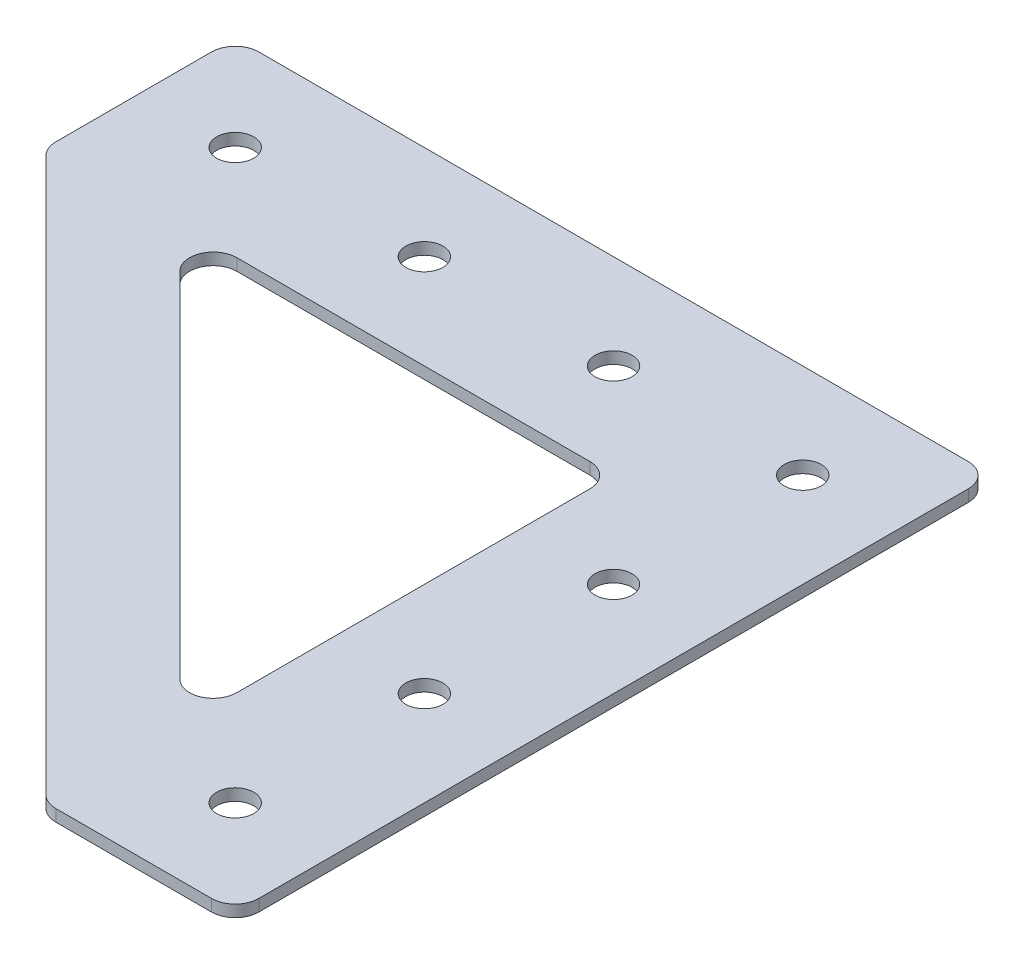
ISO-10303-21;
HEADER;
FILE_DESCRIPTION(('STEP AP214'),'2;1');
FILE_NAME('part.step','',(''),(''),'','','');
FILE_SCHEMA(('AUTOMOTIVE_DESIGN { 1 0 10303 214 1 1 1 1 }'));
ENDSEC;
DATA;
#1=APPLICATION_CONTEXT('core data for automotive mechanical design processes');
#2=APPLICATION_PROTOCOL_DEFINITION('international standard','automotive_design',2000,#1);
#3=PRODUCT_CONTEXT('',#1,'mechanical');
#4=PRODUCT('Part','Part','',(#3));
#5=PRODUCT_RELATED_PRODUCT_CATEGORY('part','',(#4));
#6=PRODUCT_DEFINITION_FORMATION('','',#4);
#7=PRODUCT_DEFINITION_CONTEXT('part definition',#1,'design');
#8=PRODUCT_DEFINITION('design','',#6,#7);
#9=PRODUCT_DEFINITION_SHAPE('','',#8);
#10=(LENGTH_UNIT() NAMED_UNIT(*) SI_UNIT(.MILLI.,.METRE.));
#11=(NAMED_UNIT(*) PLANE_ANGLE_UNIT() SI_UNIT($,.RADIAN.));
#12=(NAMED_UNIT(*) SI_UNIT($,.STERADIAN.) SOLID_ANGLE_UNIT());
#13=UNCERTAINTY_MEASURE_WITH_UNIT(LENGTH_MEASURE(1.E-05),#10,'distance_accuracy_value','');
#14=(GEOMETRIC_REPRESENTATION_CONTEXT(3) GLOBAL_UNCERTAINTY_ASSIGNED_CONTEXT((#13)) GLOBAL_UNIT_ASSIGNED_CONTEXT((#10,
#11,#12)) REPRESENTATION_CONTEXT('',''));
#15=CARTESIAN_POINT('',(0.,0.,0.));
#16=DIRECTION('',(0.,0.,1.));
#17=DIRECTION('',(1.,0.,0.));
#18=AXIS2_PLACEMENT_3D('',#15,#16,#17);
#19=CARTESIAN_POINT('',(-88.9,0.,12.7));
#20=DIRECTION('',(0.,1.,0.));
#21=DIRECTION('',(0.,0.,1.));
#22=AXIS2_PLACEMENT_3D('',#19,#20,#21);
#23=CYLINDRICAL_SURFACE('',#22,2.4892);
#24=CARTESIAN_POINT('',(-88.9,0.,12.7));
#25=DIRECTION('',(0.,1.,0.));
#26=DIRECTION('',(0.,0.,1.));
#27=AXIS2_PLACEMENT_3D('',#24,#25,#26);
#28=CIRCLE('',#27,2.4892);
#29=CARTESIAN_POINT('',(-88.9,0.,15.1892));
#30=VERTEX_POINT('',#29);
#31=EDGE_CURVE('E181',#30,#30,#28,.T.);
#32=ORIENTED_EDGE('',*,*,#31,.F.);
#33=EDGE_LOOP('',(#32));
#34=FACE_BOUND('',#33,.T.);
#35=CARTESIAN_POINT('',(-88.9,1.5875,12.7));
#36=DIRECTION('',(0.,1.,0.));
#37=DIRECTION('',(0.,0.,1.));
#38=AXIS2_PLACEMENT_3D('',#35,#36,#37);
#39=CIRCLE('',#38,2.4892);
#40=CARTESIAN_POINT('',(-88.9,1.5875,15.1892));
#41=VERTEX_POINT('',#40);
#42=EDGE_CURVE('E176',#41,#41,#39,.T.);
#43=ORIENTED_EDGE('',*,*,#42,.T.);
#44=EDGE_LOOP('',(#43));
#45=FACE_BOUND('',#44,.T.);
#46=ADVANCED_FACE('F37',(#34,#45),#23,.F.);
#47=CARTESIAN_POINT('',(-63.5,0.,12.7));
#48=DIRECTION('',(0.,1.,0.));
#49=DIRECTION('',(0.,0.,1.));
#50=AXIS2_PLACEMENT_3D('',#47,#48,#49);
#51=CYLINDRICAL_SURFACE('',#50,2.4892);
#52=CARTESIAN_POINT('',(-63.5,0.,12.7));
#53=DIRECTION('',(0.,1.,0.));
#54=DIRECTION('',(0.,0.,1.));
#55=AXIS2_PLACEMENT_3D('',#52,#53,#54);
#56=CIRCLE('',#55,2.4892);
#57=CARTESIAN_POINT('',(-63.5,0.,15.1892));
#58=VERTEX_POINT('',#57);
#59=EDGE_CURVE('E314',#58,#58,#56,.T.);
#60=ORIENTED_EDGE('',*,*,#59,.F.);
#61=EDGE_LOOP('',(#60));
#62=FACE_BOUND('',#61,.T.);
#63=CARTESIAN_POINT('',(-63.5,1.5875,12.7));
#64=DIRECTION('',(0.,1.,0.));
#65=DIRECTION('',(0.,0.,1.));
#66=AXIS2_PLACEMENT_3D('',#63,#64,#65);
#67=CIRCLE('',#66,2.4892);
#68=CARTESIAN_POINT('',(-63.5,1.5875,15.1892));
#69=VERTEX_POINT('',#68);
#70=EDGE_CURVE('E317',#69,#69,#67,.T.);
#71=ORIENTED_EDGE('',*,*,#70,.T.);
#72=EDGE_LOOP('',(#71));
#73=FACE_BOUND('',#72,.T.);
#74=ADVANCED_FACE('F325',(#62,#73),#51,.F.);
#75=CARTESIAN_POINT('',(-38.1,0.,12.7));
#76=DIRECTION('',(0.,1.,0.));
#77=DIRECTION('',(0.,0.,1.));
#78=AXIS2_PLACEMENT_3D('',#75,#76,#77);
#79=CYLINDRICAL_SURFACE('',#78,2.4892);
#80=CARTESIAN_POINT('',(-38.1,0.,12.7));
#81=DIRECTION('',(0.,1.,0.));
#82=DIRECTION('',(0.,0.,1.));
#83=AXIS2_PLACEMENT_3D('',#80,#81,#82);
#84=CIRCLE('',#83,2.4892);
#85=CARTESIAN_POINT('',(-38.1,0.,15.1892));
#86=VERTEX_POINT('',#85);
#87=EDGE_CURVE('E308',#86,#86,#84,.T.);
#88=ORIENTED_EDGE('',*,*,#87,.F.);
#89=EDGE_LOOP('',(#88));
#90=FACE_BOUND('',#89,.T.);
#91=CARTESIAN_POINT('',(-38.1,1.5875,12.7));
#92=DIRECTION('',(0.,1.,0.));
#93=DIRECTION('',(0.,0.,1.));
#94=AXIS2_PLACEMENT_3D('',#91,#92,#93);
#95=CIRCLE('',#94,2.4892);
#96=CARTESIAN_POINT('',(-38.1,1.5875,15.1892));
#97=VERTEX_POINT('',#96);
#98=EDGE_CURVE('E311',#97,#97,#95,.T.);
#99=ORIENTED_EDGE('',*,*,#98,.T.);
#100=EDGE_LOOP('',(#99));
#101=FACE_BOUND('',#100,.T.);
#102=ADVANCED_FACE('F368',(#90,#101),#79,.F.);
#103=CARTESIAN_POINT('',(-12.7,0.,88.9));
#104=DIRECTION('',(0.,1.,0.));
#105=DIRECTION('',(0.,0.,1.));
#106=AXIS2_PLACEMENT_3D('',#103,#104,#105);
#107=CYLINDRICAL_SURFACE('',#106,2.4892);
#108=CARTESIAN_POINT('',(-12.7,0.,88.9));
#109=DIRECTION('',(0.,1.,0.));
#110=DIRECTION('',(0.,0.,1.));
#111=AXIS2_PLACEMENT_3D('',#108,#109,#110);
#112=CIRCLE('',#111,2.4892);
#113=CARTESIAN_POINT('',(-12.7,0.,91.3892));
#114=VERTEX_POINT('',#113);
#115=EDGE_CURVE('E302',#114,#114,#112,.T.);
#116=ORIENTED_EDGE('',*,*,#115,.F.);
#117=EDGE_LOOP('',(#116));
#118=FACE_BOUND('',#117,.T.);
#119=CARTESIAN_POINT('',(-12.7,1.5875,88.9));
#120=DIRECTION('',(0.,1.,0.));
#121=DIRECTION('',(0.,0.,1.));
#122=AXIS2_PLACEMENT_3D('',#119,#120,#121);
#123=CIRCLE('',#122,2.4892);
#124=CARTESIAN_POINT('',(-12.7,1.5875,91.3892));
#125=VERTEX_POINT('',#124);
#126=EDGE_CURVE('E305',#125,#125,#123,.T.);
#127=ORIENTED_EDGE('',*,*,#126,.T.);
#128=EDGE_LOOP('',(#127));
#129=FACE_BOUND('',#128,.T.);
#130=ADVANCED_FACE('F340',(#118,#129),#107,.F.);
#131=CARTESIAN_POINT('',(-12.7,0.,63.5));
#132=DIRECTION('',(0.,1.,0.));
#133=DIRECTION('',(0.,0.,1.));
#134=AXIS2_PLACEMENT_3D('',#131,#132,#133);
#135=CYLINDRICAL_SURFACE('',#134,2.4892);
#136=CARTESIAN_POINT('',(-12.7,0.,63.5));
#137=DIRECTION('',(0.,1.,0.));
#138=DIRECTION('',(0.,0.,1.));
#139=AXIS2_PLACEMENT_3D('',#136,#137,#138);
#140=CIRCLE('',#139,2.4892);
#141=CARTESIAN_POINT('',(-12.7,0.,65.9892));
#142=VERTEX_POINT('',#141);
#143=EDGE_CURVE('E283',#142,#142,#140,.T.);
#144=ORIENTED_EDGE('',*,*,#143,.F.);
#145=EDGE_LOOP('',(#144));
#146=FACE_BOUND('',#145,.T.);
#147=CARTESIAN_POINT('',(-12.7,1.5875,63.5));
#148=DIRECTION('',(0.,1.,0.));
#149=DIRECTION('',(0.,0.,1.));
#150=AXIS2_PLACEMENT_3D('',#147,#148,#149);
#151=CIRCLE('',#150,2.4892);
#152=CARTESIAN_POINT('',(-12.7,1.5875,65.9892));
#153=VERTEX_POINT('',#152);
#154=EDGE_CURVE('E299',#153,#153,#151,.T.);
#155=ORIENTED_EDGE('',*,*,#154,.T.);
#156=EDGE_LOOP('',(#155));
#157=FACE_BOUND('',#156,.T.);
#158=ADVANCED_FACE('F330',(#146,#157),#135,.F.);
#159=CARTESIAN_POINT('',(0.,1.5875,0.));
#160=DIRECTION('',(0.,-1.,0.));
#161=DIRECTION('',(0.,0.,-1.));
#162=AXIS2_PLACEMENT_3D('',#159,#160,#161);
#163=PLANE('',#162);
#164=CARTESIAN_POINT('',(-12.7,1.5875,38.1));
#165=DIRECTION('',(0.,1.,0.));
#166=DIRECTION('',(0.,0.,1.));
#167=AXIS2_PLACEMENT_3D('',#164,#165,#166);
#168=CIRCLE('',#167,2.4892);
#169=CARTESIAN_POINT('',(-12.7,1.5875,40.5892));
#170=VERTEX_POINT('',#169);
#171=EDGE_CURVE('E589',#170,#170,#168,.T.);
#172=ORIENTED_EDGE('',*,*,#171,.F.);
#173=EDGE_LOOP('',(#172));
#174=FACE_BOUND('',#173,.T.);
#175=CARTESIAN_POINT('',(-12.7,1.5875,12.7));
#176=DIRECTION('',(0.,1.,0.));
#177=DIRECTION('',(0.,0.,1.));
#178=AXIS2_PLACEMENT_3D('',#175,#176,#177);
#179=CIRCLE('',#178,2.4892);
#180=CARTESIAN_POINT('',(-12.7,1.5875,15.1892));
#181=VERTEX_POINT('',#180);
#182=EDGE_CURVE('E588',#181,#181,#179,.T.);
#183=ORIENTED_EDGE('',*,*,#182,.F.);
#184=EDGE_LOOP('',(#183));
#185=FACE_BOUND('',#184,.T.);
#186=DIRECTION('',(1.,0.,0.));
#187=VECTOR('',#186,1.);
#188=CARTESIAN_POINT('',(0.,1.5875,101.6));
#189=LINE('',#188,#187);
#190=CARTESIAN_POINT('',(-24.0848719394654,1.5875,101.6));
#191=VERTEX_POINT('',#190);
#192=CARTESIAN_POINT('',(-3.17499999999999,1.5875,101.6));
#193=VERTEX_POINT('',#192);
#194=EDGE_CURVE('E280',#191,#193,#189,.T.);
#195=ORIENTED_EDGE('',*,*,#194,.T.);
#196=CARTESIAN_POINT('',(-3.17499999999999,1.5875,98.425));
#197=DIRECTION('',(0.,-1.,0.));
#198=DIRECTION('',(0.,0.,-1.));
#199=AXIS2_PLACEMENT_3D('',#196,#197,#198);
#200=CIRCLE('',#199,3.175);
#201=CARTESIAN_POINT('',(0.,1.5875,98.425));
#202=VERTEX_POINT('',#201);
#203=EDGE_CURVE('E220',#193,#202,#200,.F.);
#204=ORIENTED_EDGE('',*,*,#203,.T.);
#205=DIRECTION('',(0.,0.,-1.));
#206=VECTOR('',#205,1.);
#207=CARTESIAN_POINT('',(0.,1.5875,0.));
#208=LINE('',#207,#206);
#209=CARTESIAN_POINT('',(0.,1.5875,3.175));
#210=VERTEX_POINT('',#209);
#211=EDGE_CURVE('E269',#202,#210,#208,.T.);
#212=ORIENTED_EDGE('',*,*,#211,.T.);
#213=CARTESIAN_POINT('',(-3.175,1.5875,3.175));
#214=DIRECTION('',(0.,-1.,0.));
#215=DIRECTION('',(0.,0.,-1.));
#216=AXIS2_PLACEMENT_3D('',#213,#214,#215);
#217=CIRCLE('',#216,3.175);
#218=CARTESIAN_POINT('',(-3.175,1.5875,0.));
#219=VERTEX_POINT('',#218);
#220=EDGE_CURVE('E215',#210,#219,#217,.F.);
#221=ORIENTED_EDGE('',*,*,#220,.T.);
#222=DIRECTION('',(-1.,0.,0.));
#223=VECTOR('',#222,1.);
#224=CARTESIAN_POINT('',(0.,1.5875,0.));
#225=LINE('',#224,#223);
#226=CARTESIAN_POINT('',(-98.425,1.5875,0.));
#227=VERTEX_POINT('',#226);
#228=EDGE_CURVE('E272',#219,#227,#225,.T.);
#229=ORIENTED_EDGE('',*,*,#228,.T.);
#230=CARTESIAN_POINT('',(-98.425,1.5875,3.17500000000001));
#231=DIRECTION('',(0.,-1.,0.));
#232=DIRECTION('',(0.,0.,-1.));
#233=AXIS2_PLACEMENT_3D('',#230,#231,#232);
#234=CIRCLE('',#233,3.175);
#235=CARTESIAN_POINT('',(-101.6,1.5875,3.17500000000001));
#236=VERTEX_POINT('',#235);
#237=EDGE_CURVE('E213',#227,#236,#234,.F.);
#238=ORIENTED_EDGE('',*,*,#237,.T.);
#239=DIRECTION('',(0.,0.,1.));
#240=VECTOR('',#239,1.);
#241=CARTESIAN_POINT('',(-101.6,1.5875,0.));
#242=LINE('',#241,#240);
#243=CARTESIAN_POINT('',(-101.6,1.5875,24.0848719394655));
#244=VERTEX_POINT('',#243);
#245=EDGE_CURVE('E276',#236,#244,#242,.T.);
#246=ORIENTED_EDGE('',*,*,#245,.T.);
#247=CARTESIAN_POINT('',(-98.425,1.5875,24.0848719394655));
#248=DIRECTION('',(0.,-1.,0.));
#249=DIRECTION('',(0.,0.,-1.));
#250=AXIS2_PLACEMENT_3D('',#247,#248,#249);
#251=CIRCLE('',#250,3.175);
#252=CARTESIAN_POINT('',(-100.670064030267,1.5875,26.3299359697327));
#253=VERTEX_POINT('',#252);
#254=EDGE_CURVE('E59',#244,#253,#251,.F.);
#255=ORIENTED_EDGE('',*,*,#254,.T.);
#256=DIRECTION('',(0.707106781186548,0.,0.707106781186547));
#257=VECTOR('',#256,1.);
#258=CARTESIAN_POINT('',(-25.4,1.5875,101.6));
#259=LINE('',#258,#257);
#260=CARTESIAN_POINT('',(-26.3299359697327,1.5875,100.670064030267));
#261=VERTEX_POINT('',#260);
#262=EDGE_CURVE('E278',#253,#261,#259,.T.);
#263=ORIENTED_EDGE('',*,*,#262,.T.);
#264=CARTESIAN_POINT('',(-24.0848719394654,1.5875,98.425));
#265=DIRECTION('',(0.,-1.,0.));
#266=DIRECTION('',(0.,0.,-1.));
#267=AXIS2_PLACEMENT_3D('',#264,#265,#266);
#268=CIRCLE('',#267,3.175);
#269=EDGE_CURVE('E218',#261,#191,#268,.F.);
#270=ORIENTED_EDGE('',*,*,#269,.T.);
#271=EDGE_LOOP('',(#195,#204,#212,#221,#229,#238,#246,#255,#263,#270));
#272=FACE_BOUND('',#271,.T.);
#273=DIRECTION('',(0.707106781186548,0.,0.707106781186547));
#274=VECTOR('',#273,1.);
#275=CARTESIAN_POINT('',(-25.4,1.5875,83.6394877578617));
#276=LINE('',#275,#274);
#277=CARTESIAN_POINT('',(-78.2194237275944,1.5875,30.8200640302673));
#278=VERTEX_POINT('',#277);
#279=CARTESIAN_POINT('',(-30.8200640302673,1.5875,78.2194237275944));
#280=VERTEX_POINT('',#279);
#281=EDGE_CURVE('E260',#278,#280,#276,.T.);
#282=ORIENTED_EDGE('',*,*,#281,.F.);
#283=CARTESIAN_POINT('',(-75.9743596973271,1.5875,28.575));
#284=DIRECTION('',(0.,-1.,0.));
#285=DIRECTION('',(0.,0.,-1.));
#286=AXIS2_PLACEMENT_3D('',#283,#284,#285);
#287=CIRCLE('',#286,3.175);
#288=CARTESIAN_POINT('',(-75.9743596973271,1.5875,25.4));
#289=VERTEX_POINT('',#288);
#290=EDGE_CURVE('E11',#278,#289,#287,.T.);
#291=ORIENTED_EDGE('',*,*,#290,.T.);
#292=DIRECTION('',(-1.,0.,0.));
#293=VECTOR('',#292,1.);
#294=CARTESIAN_POINT('',(-25.4,1.5875,25.4));
#295=LINE('',#294,#293);
#296=CARTESIAN_POINT('',(-28.575,1.5875,25.4));
#297=VERTEX_POINT('',#296);
#298=EDGE_CURVE('E252',#297,#289,#295,.T.);
#299=ORIENTED_EDGE('',*,*,#298,.F.);
#300=CARTESIAN_POINT('',(-28.575,1.5875,28.575));
#301=DIRECTION('',(0.,-1.,0.));
#302=DIRECTION('',(0.,0.,-1.));
#303=AXIS2_PLACEMENT_3D('',#300,#301,#302);
#304=CIRCLE('',#303,3.175);
#305=CARTESIAN_POINT('',(-25.4,1.5875,28.575));
#306=VERTEX_POINT('',#305);
#307=EDGE_CURVE('E162',#297,#306,#304,.T.);
#308=ORIENTED_EDGE('',*,*,#307,.T.);
#309=DIRECTION('',(0.,0.,-1.));
#310=VECTOR('',#309,1.);
#311=CARTESIAN_POINT('',(-25.4,1.5875,25.4));
#312=LINE('',#311,#310);
#313=CARTESIAN_POINT('',(-25.4,1.5875,75.9743596973271));
#314=VERTEX_POINT('',#313);
#315=EDGE_CURVE('E249',#314,#306,#312,.T.);
#316=ORIENTED_EDGE('',*,*,#315,.F.);
#317=CARTESIAN_POINT('',(-28.575,1.5875,75.9743596973271));
#318=DIRECTION('',(0.,-1.,0.));
#319=DIRECTION('',(0.,0.,-1.));
#320=AXIS2_PLACEMENT_3D('',#317,#318,#319);
#321=CIRCLE('',#320,3.175);
#322=EDGE_CURVE('E238',#314,#280,#321,.T.);
#323=ORIENTED_EDGE('',*,*,#322,.T.);
#324=EDGE_LOOP('',(#282,#291,#299,#308,#316,#323));
#325=FACE_BOUND('',#324,.T.);
#326=ORIENTED_EDGE('',*,*,#154,.F.);
#327=EDGE_LOOP('',(#326));
#328=FACE_BOUND('',#327,.T.);
#329=ORIENTED_EDGE('',*,*,#126,.F.);
#330=EDGE_LOOP('',(#329));
#331=FACE_BOUND('',#330,.T.);
#332=ORIENTED_EDGE('',*,*,#98,.F.);
#333=EDGE_LOOP('',(#332));
#334=FACE_BOUND('',#333,.T.);
#335=ORIENTED_EDGE('',*,*,#70,.F.);
#336=EDGE_LOOP('',(#335));
#337=FACE_BOUND('',#336,.T.);
#338=ORIENTED_EDGE('',*,*,#42,.F.);
#339=EDGE_LOOP('',(#338));
#340=FACE_BOUND('',#339,.T.);
#341=ADVANCED_FACE('F247',(#174,#185,#272,#325,#328,#331,#334,#337,#340),#163,.F.);
#342=CARTESIAN_POINT('',(0.,0.,0.));
#343=DIRECTION('',(0.,-1.,0.));
#344=DIRECTION('',(0.,0.,-1.));
#345=AXIS2_PLACEMENT_3D('',#342,#343,#344);
#346=PLANE('',#345);
#347=CARTESIAN_POINT('',(-12.7,0.,38.1));
#348=DIRECTION('',(0.,1.,0.));
#349=DIRECTION('',(0.,0.,1.));
#350=AXIS2_PLACEMENT_3D('',#347,#348,#349);
#351=CIRCLE('',#350,2.4892);
#352=CARTESIAN_POINT('',(-12.7,0.,40.5892));
#353=VERTEX_POINT('',#352);
#354=EDGE_CURVE('E593',#353,#353,#351,.T.);
#355=ORIENTED_EDGE('',*,*,#354,.T.);
#356=EDGE_LOOP('',(#355));
#357=FACE_BOUND('',#356,.T.);
#358=CARTESIAN_POINT('',(-12.7,0.,12.7));
#359=DIRECTION('',(0.,1.,0.));
#360=DIRECTION('',(0.,0.,1.));
#361=AXIS2_PLACEMENT_3D('',#358,#359,#360);
#362=CIRCLE('',#361,2.4892);
#363=CARTESIAN_POINT('',(-12.7,0.,15.1892));
#364=VERTEX_POINT('',#363);
#365=EDGE_CURVE('E172',#364,#364,#362,.T.);
#366=ORIENTED_EDGE('',*,*,#365,.T.);
#367=EDGE_LOOP('',(#366));
#368=FACE_BOUND('',#367,.T.);
#369=DIRECTION('',(0.,0.,-1.));
#370=VECTOR('',#369,1.);
#371=CARTESIAN_POINT('',(0.,0.,0.));
#372=LINE('',#371,#370);
#373=CARTESIAN_POINT('',(0.,0.,98.425));
#374=VERTEX_POINT('',#373);
#375=CARTESIAN_POINT('',(0.,0.,3.175));
#376=VERTEX_POINT('',#375);
#377=EDGE_CURVE('E284',#374,#376,#372,.T.);
#378=ORIENTED_EDGE('',*,*,#377,.F.);
#379=CARTESIAN_POINT('',(-3.17499999999999,0.,98.425));
#380=DIRECTION('',(0.,-1.,0.));
#381=DIRECTION('',(0.,0.,-1.));
#382=AXIS2_PLACEMENT_3D('',#379,#380,#381);
#383=CIRCLE('',#382,3.175);
#384=CARTESIAN_POINT('',(-3.17499999999999,0.,101.6));
#385=VERTEX_POINT('',#384);
#386=EDGE_CURVE('E206',#374,#385,#383,.T.);
#387=ORIENTED_EDGE('',*,*,#386,.T.);
#388=DIRECTION('',(1.,0.,0.));
#389=VECTOR('',#388,1.);
#390=CARTESIAN_POINT('',(0.,0.,101.6));
#391=LINE('',#390,#389);
#392=CARTESIAN_POINT('',(-24.0848719394654,0.,101.6));
#393=VERTEX_POINT('',#392);
#394=EDGE_CURVE('E273',#393,#385,#391,.T.);
#395=ORIENTED_EDGE('',*,*,#394,.F.);
#396=CARTESIAN_POINT('',(-24.0848719394654,0.,98.425));
#397=DIRECTION('',(0.,-1.,0.));
#398=DIRECTION('',(0.,0.,-1.));
#399=AXIS2_PLACEMENT_3D('',#396,#397,#398);
#400=CIRCLE('',#399,3.175);
#401=CARTESIAN_POINT('',(-26.3299359697327,0.,100.670064030267));
#402=VERTEX_POINT('',#401);
#403=EDGE_CURVE('E204',#393,#402,#400,.T.);
#404=ORIENTED_EDGE('',*,*,#403,.T.);
#405=DIRECTION('',(0.707106781186548,0.,0.707106781186547));
#406=VECTOR('',#405,1.);
#407=CARTESIAN_POINT('',(-25.4,0.,101.6));
#408=LINE('',#407,#406);
#409=CARTESIAN_POINT('',(-100.670064030267,0.,26.3299359697327));
#410=VERTEX_POINT('',#409);
#411=EDGE_CURVE('E293',#410,#402,#408,.T.);
#412=ORIENTED_EDGE('',*,*,#411,.F.);
#413=CARTESIAN_POINT('',(-98.425,0.,24.0848719394655));
#414=DIRECTION('',(0.,-1.,0.));
#415=DIRECTION('',(0.,0.,-1.));
#416=AXIS2_PLACEMENT_3D('',#413,#414,#415);
#417=CIRCLE('',#416,3.175);
#418=CARTESIAN_POINT('',(-101.6,0.,24.0848719394655));
#419=VERTEX_POINT('',#418);
#420=EDGE_CURVE('E202',#410,#419,#417,.T.);
#421=ORIENTED_EDGE('',*,*,#420,.T.);
#422=DIRECTION('',(0.,0.,1.));
#423=VECTOR('',#422,1.);
#424=CARTESIAN_POINT('',(-101.6,0.,0.));
#425=LINE('',#424,#423);
#426=CARTESIAN_POINT('',(-101.6,0.,3.17500000000001));
#427=VERTEX_POINT('',#426);
#428=EDGE_CURVE('E290',#427,#419,#425,.T.);
#429=ORIENTED_EDGE('',*,*,#428,.F.);
#430=CARTESIAN_POINT('',(-98.425,0.,3.17500000000001));
#431=DIRECTION('',(0.,-1.,0.));
#432=DIRECTION('',(0.,0.,-1.));
#433=AXIS2_PLACEMENT_3D('',#430,#431,#432);
#434=CIRCLE('',#433,3.175);
#435=CARTESIAN_POINT('',(-98.425,0.,0.));
#436=VERTEX_POINT('',#435);
#437=EDGE_CURVE('E198',#427,#436,#434,.T.);
#438=ORIENTED_EDGE('',*,*,#437,.T.);
#439=DIRECTION('',(-1.,0.,0.));
#440=VECTOR('',#439,1.);
#441=CARTESIAN_POINT('',(0.,0.,0.));
#442=LINE('',#441,#440);
#443=CARTESIAN_POINT('',(-3.175,0.,0.));
#444=VERTEX_POINT('',#443);
#445=EDGE_CURVE('E287',#444,#436,#442,.T.);
#446=ORIENTED_EDGE('',*,*,#445,.F.);
#447=CARTESIAN_POINT('',(-3.175,0.,3.175));
#448=DIRECTION('',(0.,-1.,0.));
#449=DIRECTION('',(0.,0.,-1.));
#450=AXIS2_PLACEMENT_3D('',#447,#448,#449);
#451=CIRCLE('',#450,3.175);
#452=EDGE_CURVE('E200',#444,#376,#451,.T.);
#453=ORIENTED_EDGE('',*,*,#452,.T.);
#454=EDGE_LOOP('',(#378,#387,#395,#404,#412,#421,#429,#438,#446,#453));
#455=FACE_BOUND('',#454,.T.);
#456=DIRECTION('',(0.,0.,-1.));
#457=VECTOR('',#456,1.);
#458=CARTESIAN_POINT('',(-25.4,0.,25.4));
#459=LINE('',#458,#457);
#460=CARTESIAN_POINT('',(-25.4,0.,75.9743596973271));
#461=VERTEX_POINT('',#460);
#462=CARTESIAN_POINT('',(-25.4,0.,28.575));
#463=VERTEX_POINT('',#462);
#464=EDGE_CURVE('E171',#461,#463,#459,.T.);
#465=ORIENTED_EDGE('',*,*,#464,.T.);
#466=CARTESIAN_POINT('',(-28.575,0.,28.575));
#467=DIRECTION('',(0.,-1.,0.));
#468=DIRECTION('',(0.,0.,-1.));
#469=AXIS2_PLACEMENT_3D('',#466,#467,#468);
#470=CIRCLE('',#469,3.175);
#471=CARTESIAN_POINT('',(-28.575,0.,25.4));
#472=VERTEX_POINT('',#471);
#473=EDGE_CURVE('E240',#463,#472,#470,.F.);
#474=ORIENTED_EDGE('',*,*,#473,.T.);
#475=DIRECTION('',(-1.,0.,0.));
#476=VECTOR('',#475,1.);
#477=CARTESIAN_POINT('',(-25.4,0.,25.4));
#478=LINE('',#477,#476);
#479=CARTESIAN_POINT('',(-75.9743596973271,0.,25.4));
#480=VERTEX_POINT('',#479);
#481=EDGE_CURVE('E157',#472,#480,#478,.T.);
#482=ORIENTED_EDGE('',*,*,#481,.T.);
#483=CARTESIAN_POINT('',(-75.9743596973271,0.,28.575));
#484=DIRECTION('',(0.,-1.,0.));
#485=DIRECTION('',(0.,0.,-1.));
#486=AXIS2_PLACEMENT_3D('',#483,#484,#485);
#487=CIRCLE('',#486,3.175);
#488=CARTESIAN_POINT('',(-78.2194237275944,0.,30.8200640302673));
#489=VERTEX_POINT('',#488);
#490=EDGE_CURVE('E45',#480,#489,#487,.F.);
#491=ORIENTED_EDGE('',*,*,#490,.T.);
#492=DIRECTION('',(0.707106781186548,0.,0.707106781186547));
#493=VECTOR('',#492,1.);
#494=CARTESIAN_POINT('',(-25.4,0.,83.6394877578617));
#495=LINE('',#494,#493);
#496=CARTESIAN_POINT('',(-30.8200640302673,0.,78.2194237275944));
#497=VERTEX_POINT('',#496);
#498=EDGE_CURVE('E155',#489,#497,#495,.T.);
#499=ORIENTED_EDGE('',*,*,#498,.T.);
#500=CARTESIAN_POINT('',(-28.575,0.,75.9743596973271));
#501=DIRECTION('',(0.,-1.,0.));
#502=DIRECTION('',(0.,0.,-1.));
#503=AXIS2_PLACEMENT_3D('',#500,#501,#502);
#504=CIRCLE('',#503,3.175);
#505=EDGE_CURVE('E236',#497,#461,#504,.F.);
#506=ORIENTED_EDGE('',*,*,#505,.T.);
#507=EDGE_LOOP('',(#465,#474,#482,#491,#499,#506));
#508=FACE_BOUND('',#507,.T.);
#509=ORIENTED_EDGE('',*,*,#143,.T.);
#510=EDGE_LOOP('',(#509));
#511=FACE_BOUND('',#510,.T.);
#512=ORIENTED_EDGE('',*,*,#115,.T.);
#513=EDGE_LOOP('',(#512));
#514=FACE_BOUND('',#513,.T.);
#515=ORIENTED_EDGE('',*,*,#87,.T.);
#516=EDGE_LOOP('',(#515));
#517=FACE_BOUND('',#516,.T.);
#518=ORIENTED_EDGE('',*,*,#59,.T.);
#519=EDGE_LOOP('',(#518));
#520=FACE_BOUND('',#519,.T.);
#521=ORIENTED_EDGE('',*,*,#31,.T.);
#522=EDGE_LOOP('',(#521));
#523=FACE_BOUND('',#522,.T.);
#524=ADVANCED_FACE('F153',(#357,#368,#455,#508,#511,#514,#517,#520,#523),#346,.T.);
#525=CARTESIAN_POINT('',(0.,1.5875,0.));
#526=DIRECTION('',(-1.,0.,0.));
#527=DIRECTION('',(0.,0.,1.));
#528=AXIS2_PLACEMENT_3D('',#525,#526,#527);
#529=PLANE('',#528);
#530=ORIENTED_EDGE('',*,*,#211,.F.);
#531=DIRECTION('',(0.,-1.,0.));
#532=VECTOR('',#531,1.);
#533=CARTESIAN_POINT('',(0.,1.5875,98.425));
#534=LINE('',#533,#532);
#535=EDGE_CURVE('E195',#202,#374,#534,.T.);
#536=ORIENTED_EDGE('',*,*,#535,.T.);
#537=ORIENTED_EDGE('',*,*,#377,.T.);
#538=DIRECTION('',(0.,-1.,0.));
#539=VECTOR('',#538,1.);
#540=CARTESIAN_POINT('',(0.,1.5875,3.175));
#541=LINE('',#540,#539);
#542=EDGE_CURVE('E193',#376,#210,#541,.F.);
#543=ORIENTED_EDGE('',*,*,#542,.T.);
#544=EDGE_LOOP('',(#530,#536,#537,#543));
#545=FACE_BOUND('',#544,.T.);
#546=ADVANCED_FACE('F337',(#545),#529,.F.);
#547=CARTESIAN_POINT('',(0.,1.5875,0.));
#548=DIRECTION('',(0.,0.,1.));
#549=DIRECTION('',(1.,0.,0.));
#550=AXIS2_PLACEMENT_3D('',#547,#548,#549);
#551=PLANE('',#550);
#552=ORIENTED_EDGE('',*,*,#228,.F.);
#553=DIRECTION('',(0.,-1.,0.));
#554=VECTOR('',#553,1.);
#555=CARTESIAN_POINT('',(-3.175,1.5875,0.));
#556=LINE('',#555,#554);
#557=EDGE_CURVE('E233',#219,#444,#556,.T.);
#558=ORIENTED_EDGE('',*,*,#557,.T.);
#559=ORIENTED_EDGE('',*,*,#445,.T.);
#560=DIRECTION('',(0.,-1.,0.));
#561=VECTOR('',#560,1.);
#562=CARTESIAN_POINT('',(-98.425,1.5875,0.));
#563=LINE('',#562,#561);
#564=EDGE_CURVE('E231',#436,#227,#563,.F.);
#565=ORIENTED_EDGE('',*,*,#564,.T.);
#566=EDGE_LOOP('',(#552,#558,#559,#565));
#567=FACE_BOUND('',#566,.T.);
#568=ADVANCED_FACE('F358',(#567),#551,.F.);
#569=CARTESIAN_POINT('',(-101.6,1.5875,0.));
#570=DIRECTION('',(1.,0.,0.));
#571=DIRECTION('',(0.,0.,-1.));
#572=AXIS2_PLACEMENT_3D('',#569,#570,#571);
#573=PLANE('',#572);
#574=ORIENTED_EDGE('',*,*,#428,.T.);
#575=DIRECTION('',(0.,-1.,0.));
#576=VECTOR('',#575,1.);
#577=CARTESIAN_POINT('',(-101.6,1.5875,24.0848719394655));
#578=LINE('',#577,#576);
#579=EDGE_CURVE('E229',#419,#244,#578,.F.);
#580=ORIENTED_EDGE('',*,*,#579,.T.);
#581=ORIENTED_EDGE('',*,*,#245,.F.);
#582=DIRECTION('',(0.,-1.,0.));
#583=VECTOR('',#582,1.);
#584=CARTESIAN_POINT('',(-101.6,1.5875,3.17500000000001));
#585=LINE('',#584,#583);
#586=EDGE_CURVE('E226',#236,#427,#585,.T.);
#587=ORIENTED_EDGE('',*,*,#586,.T.);
#588=EDGE_LOOP('',(#574,#580,#581,#587));
#589=FACE_BOUND('',#588,.T.);
#590=ADVANCED_FACE('F355',(#589),#573,.F.);
#591=CARTESIAN_POINT('',(-25.4,1.5875,101.6));
#592=DIRECTION('',(0.707106781186547,0.,-0.707106781186548));
#593=DIRECTION('',(-0.707106781186548,0.,-0.707106781186547));
#594=AXIS2_PLACEMENT_3D('',#591,#592,#593);
#595=PLANE('',#594);
#596=ORIENTED_EDGE('',*,*,#411,.T.);
#597=DIRECTION('',(0.,-1.,0.));
#598=VECTOR('',#597,1.);
#599=CARTESIAN_POINT('',(-26.3299359697327,1.5875,100.670064030267));
#600=LINE('',#599,#598);
#601=EDGE_CURVE('E52',#402,#261,#600,.F.);
#602=ORIENTED_EDGE('',*,*,#601,.T.);
#603=ORIENTED_EDGE('',*,*,#262,.F.);
#604=DIRECTION('',(0.,-1.,0.));
#605=VECTOR('',#604,1.);
#606=CARTESIAN_POINT('',(-100.670064030267,1.5875,26.3299359697327));
#607=LINE('',#606,#605);
#608=EDGE_CURVE('E222',#253,#410,#607,.T.);
#609=ORIENTED_EDGE('',*,*,#608,.T.);
#610=EDGE_LOOP('',(#596,#602,#603,#609));
#611=FACE_BOUND('',#610,.T.);
#612=ADVANCED_FACE('F351',(#611),#595,.F.);
#613=CARTESIAN_POINT('',(0.,1.5875,101.6));
#614=DIRECTION('',(0.,0.,-1.));
#615=DIRECTION('',(-1.,0.,0.));
#616=AXIS2_PLACEMENT_3D('',#613,#614,#615);
#617=PLANE('',#616);
#618=ORIENTED_EDGE('',*,*,#394,.T.);
#619=DIRECTION('',(0.,-1.,0.));
#620=VECTOR('',#619,1.);
#621=CARTESIAN_POINT('',(-3.17499999999999,1.5875,101.6));
#622=LINE('',#621,#620);
#623=EDGE_CURVE('E211',#385,#193,#622,.F.);
#624=ORIENTED_EDGE('',*,*,#623,.T.);
#625=ORIENTED_EDGE('',*,*,#194,.F.);
#626=DIRECTION('',(0.,-1.,0.));
#627=VECTOR('',#626,1.);
#628=CARTESIAN_POINT('',(-24.0848719394654,1.5875,101.6));
#629=LINE('',#628,#627);
#630=EDGE_CURVE('E208',#191,#393,#629,.T.);
#631=ORIENTED_EDGE('',*,*,#630,.T.);
#632=EDGE_LOOP('',(#618,#624,#625,#631));
#633=FACE_BOUND('',#632,.T.);
#634=ADVANCED_FACE('F348',(#633),#617,.F.);
#635=CARTESIAN_POINT('',(-25.4,1.5875,83.6394877578617));
#636=DIRECTION('',(0.707106781186547,0.,-0.707106781186548));
#637=DIRECTION('',(-0.707106781186548,0.,-0.707106781186547));
#638=AXIS2_PLACEMENT_3D('',#635,#636,#637);
#639=PLANE('',#638);
#640=ORIENTED_EDGE('',*,*,#281,.T.);
#641=DIRECTION('',(0.,-1.,0.));
#642=VECTOR('',#641,1.);
#643=CARTESIAN_POINT('',(-30.8200640302673,0.,78.2194237275944));
#644=LINE('',#643,#642);
#645=EDGE_CURVE('E170',#280,#497,#644,.T.);
#646=ORIENTED_EDGE('',*,*,#645,.T.);
#647=ORIENTED_EDGE('',*,*,#498,.F.);
#648=DIRECTION('',(0.,-1.,0.));
#649=VECTOR('',#648,1.);
#650=CARTESIAN_POINT('',(-78.2194237275944,1.5875,30.8200640302673));
#651=LINE('',#650,#649);
#652=EDGE_CURVE('E167',#489,#278,#651,.F.);
#653=ORIENTED_EDGE('',*,*,#652,.T.);
#654=EDGE_LOOP('',(#640,#646,#647,#653));
#655=FACE_BOUND('',#654,.T.);
#656=ADVANCED_FACE('F166',(#655),#639,.T.);
#657=CARTESIAN_POINT('',(-25.4,1.5875,25.4));
#658=DIRECTION('',(-1.,0.,0.));
#659=DIRECTION('',(0.,0.,1.));
#660=AXIS2_PLACEMENT_3D('',#657,#658,#659);
#661=PLANE('',#660);
#662=ORIENTED_EDGE('',*,*,#464,.F.);
#663=DIRECTION('',(0.,-1.,0.));
#664=VECTOR('',#663,1.);
#665=CARTESIAN_POINT('',(-25.4,1.5875,75.9743596973271));
#666=LINE('',#665,#664);
#667=EDGE_CURVE('E187',#461,#314,#666,.F.);
#668=ORIENTED_EDGE('',*,*,#667,.T.);
#669=ORIENTED_EDGE('',*,*,#315,.T.);
#670=DIRECTION('',(0.,-1.,0.));
#671=VECTOR('',#670,1.);
#672=CARTESIAN_POINT('',(-25.4,0.,28.575));
#673=LINE('',#672,#671);
#674=EDGE_CURVE('E178',#306,#463,#673,.T.);
#675=ORIENTED_EDGE('',*,*,#674,.T.);
#676=EDGE_LOOP('',(#662,#668,#669,#675));
#677=FACE_BOUND('',#676,.T.);
#678=ADVANCED_FACE('F258',(#677),#661,.T.);
#679=CARTESIAN_POINT('',(-25.4,1.5875,25.4));
#680=DIRECTION('',(0.,0.,1.));
#681=DIRECTION('',(1.,0.,0.));
#682=AXIS2_PLACEMENT_3D('',#679,#680,#681);
#683=PLANE('',#682);
#684=ORIENTED_EDGE('',*,*,#481,.F.);
#685=DIRECTION('',(0.,-1.,0.));
#686=VECTOR('',#685,1.);
#687=CARTESIAN_POINT('',(-28.575,1.5875,25.4));
#688=LINE('',#687,#686);
#689=EDGE_CURVE('E191',#472,#297,#688,.F.);
#690=ORIENTED_EDGE('',*,*,#689,.T.);
#691=ORIENTED_EDGE('',*,*,#298,.T.);
#692=DIRECTION('',(0.,-1.,0.));
#693=VECTOR('',#692,1.);
#694=CARTESIAN_POINT('',(-75.9743596973271,0.,25.4));
#695=LINE('',#694,#693);
#696=EDGE_CURVE('E189',#289,#480,#695,.T.);
#697=ORIENTED_EDGE('',*,*,#696,.T.);
#698=EDGE_LOOP('',(#684,#690,#691,#697));
#699=FACE_BOUND('',#698,.T.);
#700=ADVANCED_FACE('F264',(#699),#683,.T.);
#701=CARTESIAN_POINT('',(-12.7,0.,12.7));
#702=DIRECTION('',(0.,1.,0.));
#703=DIRECTION('',(0.,0.,1.));
#704=AXIS2_PLACEMENT_3D('',#701,#702,#703);
#705=CYLINDRICAL_SURFACE('',#704,2.4892);
#706=ORIENTED_EDGE('',*,*,#365,.F.);
#707=EDGE_LOOP('',(#706));
#708=FACE_BOUND('',#707,.T.);
#709=ORIENTED_EDGE('',*,*,#182,.T.);
#710=EDGE_LOOP('',(#709));
#711=FACE_BOUND('',#710,.T.);
#712=ADVANCED_FACE('F479',(#708,#711),#705,.F.);
#713=CARTESIAN_POINT('',(-12.7,0.,38.1));
#714=DIRECTION('',(0.,1.,0.));
#715=DIRECTION('',(0.,0.,1.));
#716=AXIS2_PLACEMENT_3D('',#713,#714,#715);
#717=CYLINDRICAL_SURFACE('',#716,2.4892);
#718=ORIENTED_EDGE('',*,*,#354,.F.);
#719=EDGE_LOOP('',(#718));
#720=FACE_BOUND('',#719,.T.);
#721=ORIENTED_EDGE('',*,*,#171,.T.);
#722=EDGE_LOOP('',(#721));
#723=FACE_BOUND('',#722,.T.);
#724=ADVANCED_FACE('F379',(#720,#723),#717,.F.);
#725=CARTESIAN_POINT('',(-28.575,1.5875,75.9743596973271));
#726=DIRECTION('',(0.,1.,0.));
#727=DIRECTION('',(0.,0.,1.));
#728=AXIS2_PLACEMENT_3D('',#725,#726,#727);
#729=CYLINDRICAL_SURFACE('',#728,3.175);
#730=ORIENTED_EDGE('',*,*,#322,.F.);
#731=ORIENTED_EDGE('',*,*,#667,.F.);
#732=ORIENTED_EDGE('',*,*,#505,.F.);
#733=ORIENTED_EDGE('',*,*,#645,.F.);
#734=EDGE_LOOP('',(#730,#731,#732,#733));
#735=FACE_BOUND('',#734,.T.);
#736=ADVANCED_FACE('F376',(#735),#729,.F.);
#737=CARTESIAN_POINT('',(-28.575,1.5875,28.575));
#738=DIRECTION('',(0.,1.,0.));
#739=DIRECTION('',(0.,0.,1.));
#740=AXIS2_PLACEMENT_3D('',#737,#738,#739);
#741=CYLINDRICAL_SURFACE('',#740,3.175);
#742=ORIENTED_EDGE('',*,*,#307,.F.);
#743=ORIENTED_EDGE('',*,*,#689,.F.);
#744=ORIENTED_EDGE('',*,*,#473,.F.);
#745=ORIENTED_EDGE('',*,*,#674,.F.);
#746=EDGE_LOOP('',(#742,#743,#744,#745));
#747=FACE_BOUND('',#746,.T.);
#748=ADVANCED_FACE('F262',(#747),#741,.F.);
#749=CARTESIAN_POINT('',(-75.9743596973271,1.5875,28.575));
#750=DIRECTION('',(0.,1.,0.));
#751=DIRECTION('',(0.,0.,1.));
#752=AXIS2_PLACEMENT_3D('',#749,#750,#751);
#753=CYLINDRICAL_SURFACE('',#752,3.175);
#754=ORIENTED_EDGE('',*,*,#290,.F.);
#755=ORIENTED_EDGE('',*,*,#652,.F.);
#756=ORIENTED_EDGE('',*,*,#490,.F.);
#757=ORIENTED_EDGE('',*,*,#696,.F.);
#758=EDGE_LOOP('',(#754,#755,#756,#757));
#759=FACE_BOUND('',#758,.T.);
#760=ADVANCED_FACE('F175',(#759),#753,.F.);
#761=CARTESIAN_POINT('',(-3.17499999999999,1.5875,98.425));
#762=DIRECTION('',(0.,-1.,0.));
#763=DIRECTION('',(0.,0.,-1.));
#764=AXIS2_PLACEMENT_3D('',#761,#762,#763);
#765=CYLINDRICAL_SURFACE('',#764,3.175);
#766=ORIENTED_EDGE('',*,*,#203,.F.);
#767=ORIENTED_EDGE('',*,*,#623,.F.);
#768=ORIENTED_EDGE('',*,*,#386,.F.);
#769=ORIENTED_EDGE('',*,*,#535,.F.);
#770=EDGE_LOOP('',(#766,#767,#768,#769));
#771=FACE_BOUND('',#770,.T.);
#772=ADVANCED_FACE('F385',(#771),#765,.T.);
#773=CARTESIAN_POINT('',(-24.0848719394654,1.5875,98.425));
#774=DIRECTION('',(0.,-1.,0.));
#775=DIRECTION('',(0.,0.,-1.));
#776=AXIS2_PLACEMENT_3D('',#773,#774,#775);
#777=CYLINDRICAL_SURFACE('',#776,3.175);
#778=ORIENTED_EDGE('',*,*,#269,.F.);
#779=ORIENTED_EDGE('',*,*,#601,.F.);
#780=ORIENTED_EDGE('',*,*,#403,.F.);
#781=ORIENTED_EDGE('',*,*,#630,.F.);
#782=EDGE_LOOP('',(#778,#779,#780,#781));
#783=FACE_BOUND('',#782,.T.);
#784=ADVANCED_FACE('F388',(#783),#777,.T.);
#785=CARTESIAN_POINT('',(-98.425,1.5875,24.0848719394655));
#786=DIRECTION('',(0.,-1.,0.));
#787=DIRECTION('',(0.,0.,-1.));
#788=AXIS2_PLACEMENT_3D('',#785,#786,#787);
#789=CYLINDRICAL_SURFACE('',#788,3.175);
#790=ORIENTED_EDGE('',*,*,#254,.F.);
#791=ORIENTED_EDGE('',*,*,#579,.F.);
#792=ORIENTED_EDGE('',*,*,#420,.F.);
#793=ORIENTED_EDGE('',*,*,#608,.F.);
#794=EDGE_LOOP('',(#790,#791,#792,#793));
#795=FACE_BOUND('',#794,.T.);
#796=ADVANCED_FACE('F392',(#795),#789,.T.);
#797=CARTESIAN_POINT('',(-3.175,1.5875,3.175));
#798=DIRECTION('',(0.,-1.,0.));
#799=DIRECTION('',(0.,0.,-1.));
#800=AXIS2_PLACEMENT_3D('',#797,#798,#799);
#801=CYLINDRICAL_SURFACE('',#800,3.175);
#802=ORIENTED_EDGE('',*,*,#220,.F.);
#803=ORIENTED_EDGE('',*,*,#542,.F.);
#804=ORIENTED_EDGE('',*,*,#452,.F.);
#805=ORIENTED_EDGE('',*,*,#557,.F.);
#806=EDGE_LOOP('',(#802,#803,#804,#805));
#807=FACE_BOUND('',#806,.T.);
#808=ADVANCED_FACE('F395',(#807),#801,.T.);
#809=CARTESIAN_POINT('',(-98.425,1.5875,3.17500000000001));
#810=DIRECTION('',(0.,-1.,0.));
#811=DIRECTION('',(0.,0.,-1.));
#812=AXIS2_PLACEMENT_3D('',#809,#810,#811);
#813=CYLINDRICAL_SURFACE('',#812,3.175);
#814=ORIENTED_EDGE('',*,*,#237,.F.);
#815=ORIENTED_EDGE('',*,*,#564,.F.);
#816=ORIENTED_EDGE('',*,*,#437,.F.);
#817=ORIENTED_EDGE('',*,*,#586,.F.);
#818=EDGE_LOOP('',(#814,#815,#816,#817));
#819=FACE_BOUND('',#818,.T.);
#820=ADVANCED_FACE('F39',(#819),#813,.T.);
#821=CLOSED_SHELL('',(#46,#74,#102,#130,#158,#341,#524,#546,#568,#590,#612,#634,#656,#678,#700,
#712,#724,#736,#748,#760,#772,#784,#796,#808,#820));
#822=MANIFOLD_SOLID_BREP('B2',#821);
#823=ADVANCED_BREP_SHAPE_REPRESENTATION('',(#18,#822),#14);
#824=SHAPE_DEFINITION_REPRESENTATION(#9,#823);
ENDSEC;
END-ISO-10303-21;
